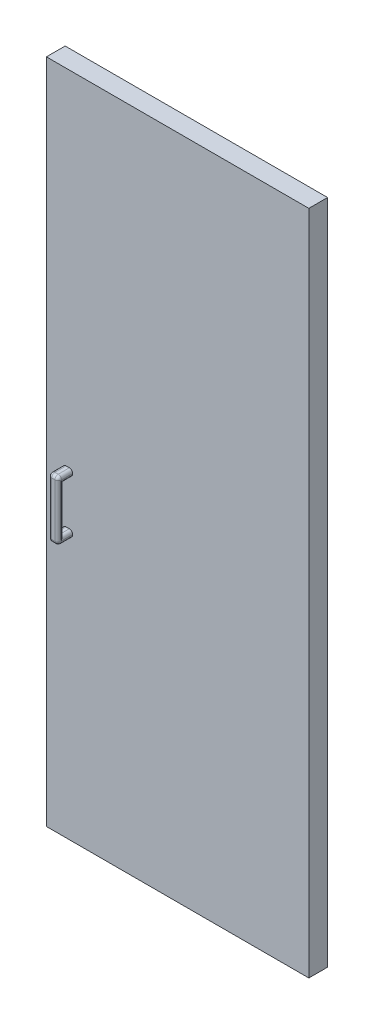
ISO-10303-21;
HEADER;
FILE_DESCRIPTION(('STEP AP214'),'2;1');
FILE_NAME('part.step','',(''),(''),'','','');
FILE_SCHEMA(('AUTOMOTIVE_DESIGN { 1 0 10303 214 1 1 1 1 }'));
ENDSEC;
DATA;
#1=APPLICATION_CONTEXT('core data for automotive mechanical design processes');
#2=APPLICATION_PROTOCOL_DEFINITION('international standard','automotive_design',2000,#1);
#3=PRODUCT_CONTEXT('',#1,'mechanical');
#4=PRODUCT('Part','Part','',(#3));
#5=PRODUCT_RELATED_PRODUCT_CATEGORY('part','',(#4));
#6=PRODUCT_DEFINITION_FORMATION('','',#4);
#7=PRODUCT_DEFINITION_CONTEXT('part definition',#1,'design');
#8=PRODUCT_DEFINITION('design','',#6,#7);
#9=PRODUCT_DEFINITION_SHAPE('','',#8);
#10=(LENGTH_UNIT() NAMED_UNIT(*) SI_UNIT(.MILLI.,.METRE.));
#11=(NAMED_UNIT(*) PLANE_ANGLE_UNIT() SI_UNIT($,.RADIAN.));
#12=(NAMED_UNIT(*) SI_UNIT($,.STERADIAN.) SOLID_ANGLE_UNIT());
#13=UNCERTAINTY_MEASURE_WITH_UNIT(LENGTH_MEASURE(1.E-05),#10,'distance_accuracy_value','');
#14=(GEOMETRIC_REPRESENTATION_CONTEXT(3) GLOBAL_UNCERTAINTY_ASSIGNED_CONTEXT((#13)) GLOBAL_UNIT_ASSIGNED_CONTEXT((#10,
#11,#12)) REPRESENTATION_CONTEXT('',''));
#15=CARTESIAN_POINT('',(0.,0.,0.));
#16=DIRECTION('',(0.,0.,1.));
#17=DIRECTION('',(1.,0.,0.));
#18=AXIS2_PLACEMENT_3D('',#15,#16,#17);
#19=CARTESIAN_POINT('',(0.,0.,0.));
#20=DIRECTION('',(0.,0.,1.));
#21=DIRECTION('',(1.,0.,0.));
#22=AXIS2_PLACEMENT_3D('',#19,#20,#21);
#23=PLANE('',#22);
#24=DIRECTION('',(-1.,0.,0.));
#25=VECTOR('',#24,1.);
#26=CARTESIAN_POINT('',(0.,446.201837212028,0.));
#27=LINE('',#26,#25);
#28=CARTESIAN_POINT('',(0.,446.201837212028,0.));
#29=VERTEX_POINT('',#28);
#30=CARTESIAN_POINT('',(-800.,446.201837212028,0.));
#31=VERTEX_POINT('',#30);
#32=EDGE_CURVE('E281',#29,#31,#27,.T.);
#33=ORIENTED_EDGE('',*,*,#32,.F.);
#34=DIRECTION('',(0.,1.,0.));
#35=VECTOR('',#34,1.);
#36=CARTESIAN_POINT('',(0.,0.,0.));
#37=LINE('',#36,#35);
#38=CARTESIAN_POINT('',(0.,-1585.79816278797,0.));
#39=VERTEX_POINT('',#38);
#40=EDGE_CURVE('E286',#39,#29,#37,.T.);
#41=ORIENTED_EDGE('',*,*,#40,.F.);
#42=DIRECTION('',(1.,0.,0.));
#43=VECTOR('',#42,1.);
#44=CARTESIAN_POINT('',(-800.,-1585.79816278797,0.));
#45=LINE('',#44,#43);
#46=CARTESIAN_POINT('',(-800.,-1585.79816278797,0.));
#47=VERTEX_POINT('',#46);
#48=EDGE_CURVE('E297',#47,#39,#45,.T.);
#49=ORIENTED_EDGE('',*,*,#48,.F.);
#50=DIRECTION('',(0.,-1.,0.));
#51=VECTOR('',#50,1.);
#52=CARTESIAN_POINT('',(-800.,446.201837212028,0.));
#53=LINE('',#52,#51);
#54=EDGE_CURVE('E295',#31,#47,#53,.T.);
#55=ORIENTED_EDGE('',*,*,#54,.F.);
#56=EDGE_LOOP('',(#33,#41,#49,#55));
#57=FACE_BOUND('',#56,.T.);
#58=DIRECTION('',(0.,1.,0.));
#59=VECTOR('',#58,1.);
#60=CARTESIAN_POINT('',(-775.,-924.798162787972,0.));
#61=LINE('',#60,#59);
#62=CARTESIAN_POINT('',(-775.,-924.798162787972,0.));
#63=VERTEX_POINT('',#62);
#64=CARTESIAN_POINT('',(-775.,-464.798162787972,0.));
#65=VERTEX_POINT('',#64);
#66=EDGE_CURVE('E245',#63,#65,#61,.T.);
#67=ORIENTED_EDGE('',*,*,#66,.F.);
#68=DIRECTION('',(-1.,0.,0.));
#69=VECTOR('',#68,1.);
#70=CARTESIAN_POINT('',(-655.,-924.798162787972,0.));
#71=LINE('',#70,#69);
#72=CARTESIAN_POINT('',(-655.,-924.798162787972,0.));
#73=VERTEX_POINT('',#72);
#74=EDGE_CURVE('E242',#73,#63,#71,.T.);
#75=ORIENTED_EDGE('',*,*,#74,.F.);
#76=DIRECTION('',(0.,-1.,0.));
#77=VECTOR('',#76,1.);
#78=CARTESIAN_POINT('',(-655.,-924.798162787972,0.));
#79=LINE('',#78,#77);
#80=CARTESIAN_POINT('',(-655.,-464.798162787972,0.));
#81=VERTEX_POINT('',#80);
#82=EDGE_CURVE('E61',#81,#73,#79,.T.);
#83=ORIENTED_EDGE('',*,*,#82,.F.);
#84=DIRECTION('',(1.,0.,0.));
#85=VECTOR('',#84,1.);
#86=CARTESIAN_POINT('',(-655.,-464.798162787972,0.));
#87=LINE('',#86,#85);
#88=EDGE_CURVE('E56',#65,#81,#87,.T.);
#89=ORIENTED_EDGE('',*,*,#88,.F.);
#90=EDGE_LOOP('',(#67,#75,#83,#89));
#91=FACE_BOUND('',#90,.T.);
#92=ADVANCED_FACE('F39',(#57,#91),#23,.F.);
#93=CARTESIAN_POINT('',(-720.,-603.798162787972,101.15));
#94=DIRECTION('',(-1.,0.,0.));
#95=DIRECTION('',(0.,0.,1.));
#96=AXIS2_PLACEMENT_3D('',#93,#94,#95);
#97=PLANE('',#96);
#98=DIRECTION('',(0.,1.,0.));
#99=VECTOR('',#98,1.);
#100=CARTESIAN_POINT('',(-720.,-603.798162787972,57.15));
#101=LINE('',#100,#99);
#102=CARTESIAN_POINT('',(-720.,-614.798162787972,57.15));
#103=VERTEX_POINT('',#102);
#104=CARTESIAN_POINT('',(-720.,-613.798162787972,57.15));
#105=VERTEX_POINT('',#104);
#106=EDGE_CURVE('E274',#103,#105,#101,.T.);
#107=ORIENTED_EDGE('',*,*,#106,.T.);
#108=DIRECTION('',(0.,0.,-1.));
#109=VECTOR('',#108,1.);
#110=CARTESIAN_POINT('',(-720.,-613.798162787972,101.15));
#111=LINE('',#110,#109);
#112=CARTESIAN_POINT('',(-720.,-613.798162787972,91.15));
#113=VERTEX_POINT('',#112);
#114=EDGE_CURVE('E350',#105,#113,#111,.F.);
#115=ORIENTED_EDGE('',*,*,#114,.T.);
#116=DIRECTION('',(0.,1.,0.));
#117=VECTOR('',#116,1.);
#118=CARTESIAN_POINT('',(-720.,-785.798162787972,91.15));
#119=LINE('',#118,#117);
#120=CARTESIAN_POINT('',(-720.,-614.798162787972,91.15));
#121=VERTEX_POINT('',#120);
#122=EDGE_CURVE('E346',#113,#121,#119,.F.);
#123=ORIENTED_EDGE('',*,*,#122,.T.);
#124=DIRECTION('',(0.,0.,-1.));
#125=VECTOR('',#124,1.);
#126=CARTESIAN_POINT('',(-720.,-614.798162787972,101.15));
#127=LINE('',#126,#125);
#128=EDGE_CURVE('E348',#121,#103,#127,.T.);
#129=ORIENTED_EDGE('',*,*,#128,.T.);
#130=EDGE_LOOP('',(#107,#115,#123,#129));
#131=FACE_BOUND('',#130,.T.);
#132=ADVANCED_FACE('F552',(#131),#97,.F.);
#133=CARTESIAN_POINT('',(-750.,-603.798162787972,101.15));
#134=DIRECTION('',(1.,0.,0.));
#135=DIRECTION('',(0.,0.,-1.));
#136=AXIS2_PLACEMENT_3D('',#133,#134,#135);
#137=PLANE('',#136);
#138=DIRECTION('',(0.,-1.,0.));
#139=VECTOR('',#138,1.);
#140=CARTESIAN_POINT('',(-750.,-603.798162787972,91.15));
#141=LINE('',#140,#139);
#142=CARTESIAN_POINT('',(-750.,-614.798162787972,91.15));
#143=VERTEX_POINT('',#142);
#144=CARTESIAN_POINT('',(-750.,-613.798162787972,91.15));
#145=VERTEX_POINT('',#144);
#146=EDGE_CURVE('E318',#143,#145,#141,.F.);
#147=ORIENTED_EDGE('',*,*,#146,.T.);
#148=DIRECTION('',(0.,0.,-1.));
#149=VECTOR('',#148,1.);
#150=CARTESIAN_POINT('',(-750.,-613.798162787972,101.15));
#151=LINE('',#150,#149);
#152=CARTESIAN_POINT('',(-750.,-613.798162787972,57.15));
#153=VERTEX_POINT('',#152);
#154=EDGE_CURVE('E322',#145,#153,#151,.T.);
#155=ORIENTED_EDGE('',*,*,#154,.T.);
#156=DIRECTION('',(0.,-1.,0.));
#157=VECTOR('',#156,1.);
#158=CARTESIAN_POINT('',(-750.,-603.798162787972,57.15));
#159=LINE('',#158,#157);
#160=CARTESIAN_POINT('',(-750.,-614.798162787972,57.15));
#161=VERTEX_POINT('',#160);
#162=EDGE_CURVE('E270',#153,#161,#159,.T.);
#163=ORIENTED_EDGE('',*,*,#162,.T.);
#164=DIRECTION('',(0.,0.,-1.));
#165=VECTOR('',#164,1.);
#166=CARTESIAN_POINT('',(-750.,-614.798162787972,101.15));
#167=LINE('',#166,#165);
#168=EDGE_CURVE('E320',#161,#143,#167,.F.);
#169=ORIENTED_EDGE('',*,*,#168,.T.);
#170=EDGE_LOOP('',(#147,#155,#163,#169));
#171=FACE_BOUND('',#170,.T.);
#172=ADVANCED_FACE('F519',(#171),#137,.F.);
#173=CARTESIAN_POINT('',(0.,0.,57.15));
#174=DIRECTION('',(0.,0.,1.));
#175=DIRECTION('',(1.,0.,0.));
#176=AXIS2_PLACEMENT_3D('',#173,#174,#175);
#177=PLANE('',#176);
#178=ORIENTED_EDGE('',*,*,#106,.F.);
#179=CARTESIAN_POINT('',(-730.,-614.798162787972,57.15));
#180=DIRECTION('',(0.,0.,1.));
#181=DIRECTION('',(1.,0.,0.));
#182=AXIS2_PLACEMENT_3D('',#179,#180,#181);
#183=CIRCLE('',#182,10.);
#184=CARTESIAN_POINT('',(-730.,-624.798162787972,57.15));
#185=VERTEX_POINT('',#184);
#186=EDGE_CURVE('E374',#103,#185,#183,.F.);
#187=ORIENTED_EDGE('',*,*,#186,.T.);
#188=DIRECTION('',(-1.,0.,0.));
#189=VECTOR('',#188,1.);
#190=CARTESIAN_POINT('',(-692.85,-624.798162787972,57.15));
#191=LINE('',#190,#189);
#192=CARTESIAN_POINT('',(-740.,-624.798162787972,57.15));
#193=VERTEX_POINT('',#192);
#194=EDGE_CURVE('E255',#185,#193,#191,.T.);
#195=ORIENTED_EDGE('',*,*,#194,.T.);
#196=CARTESIAN_POINT('',(-740.,-614.798162787972,57.15));
#197=DIRECTION('',(0.,0.,1.));
#198=DIRECTION('',(1.,0.,0.));
#199=AXIS2_PLACEMENT_3D('',#196,#197,#198);
#200=CIRCLE('',#199,10.);
#201=EDGE_CURVE('E376',#193,#161,#200,.F.);
#202=ORIENTED_EDGE('',*,*,#201,.T.);
#203=ORIENTED_EDGE('',*,*,#162,.F.);
#204=CARTESIAN_POINT('',(-740.,-613.798162787972,57.15));
#205=DIRECTION('',(0.,0.,1.));
#206=DIRECTION('',(1.,0.,0.));
#207=AXIS2_PLACEMENT_3D('',#204,#205,#206);
#208=CIRCLE('',#207,10.);
#209=CARTESIAN_POINT('',(-740.,-603.798162787972,57.15));
#210=VERTEX_POINT('',#209);
#211=EDGE_CURVE('E370',#153,#210,#208,.F.);
#212=ORIENTED_EDGE('',*,*,#211,.T.);
#213=DIRECTION('',(-1.,0.,0.));
#214=VECTOR('',#213,1.);
#215=CARTESIAN_POINT('',(-750.,-603.798162787972,57.15));
#216=LINE('',#215,#214);
#217=CARTESIAN_POINT('',(-730.,-603.798162787972,57.15));
#218=VERTEX_POINT('',#217);
#219=EDGE_CURVE('E278',#218,#210,#216,.T.);
#220=ORIENTED_EDGE('',*,*,#219,.F.);
#221=CARTESIAN_POINT('',(-730.,-613.798162787972,57.15));
#222=DIRECTION('',(0.,0.,1.));
#223=DIRECTION('',(1.,0.,0.));
#224=AXIS2_PLACEMENT_3D('',#221,#222,#223);
#225=CIRCLE('',#224,10.);
#226=EDGE_CURVE('E372',#218,#105,#225,.F.);
#227=ORIENTED_EDGE('',*,*,#226,.T.);
#228=EDGE_LOOP('',(#178,#187,#195,#202,#203,#212,#220,#227));
#229=FACE_BOUND('',#228,.T.);
#230=DIRECTION('',(-1.,0.,0.));
#231=VECTOR('',#230,1.);
#232=CARTESIAN_POINT('',(-692.85,-764.798162787972,57.15));
#233=LINE('',#232,#231);
#234=CARTESIAN_POINT('',(-730.,-764.798162787972,57.15));
#235=VERTEX_POINT('',#234);
#236=CARTESIAN_POINT('',(-740.,-764.798162787972,57.15));
#237=VERTEX_POINT('',#236);
#238=EDGE_CURVE('E265',#235,#237,#233,.T.);
#239=ORIENTED_EDGE('',*,*,#238,.F.);
#240=CARTESIAN_POINT('',(-730.,-774.798162787972,57.15));
#241=DIRECTION('',(0.,0.,1.));
#242=DIRECTION('',(1.,0.,0.));
#243=AXIS2_PLACEMENT_3D('',#240,#241,#242);
#244=CIRCLE('',#243,10.);
#245=CARTESIAN_POINT('',(-720.,-774.798162787972,57.15));
#246=VERTEX_POINT('',#245);
#247=EDGE_CURVE('E378',#235,#246,#244,.F.);
#248=ORIENTED_EDGE('',*,*,#247,.T.);
#249=CARTESIAN_POINT('',(-720.,-775.798162787972,57.15));
#250=VERTEX_POINT('',#249);
#251=EDGE_CURVE('E275',#250,#246,#101,.T.);
#252=ORIENTED_EDGE('',*,*,#251,.F.);
#253=CARTESIAN_POINT('',(-730.,-775.798162787972,57.15));
#254=DIRECTION('',(0.,0.,1.));
#255=DIRECTION('',(1.,0.,0.));
#256=AXIS2_PLACEMENT_3D('',#253,#254,#255);
#257=CIRCLE('',#256,10.);
#258=CARTESIAN_POINT('',(-730.,-785.798162787972,57.15));
#259=VERTEX_POINT('',#258);
#260=EDGE_CURVE('E11',#250,#259,#257,.F.);
#261=ORIENTED_EDGE('',*,*,#260,.T.);
#262=DIRECTION('',(1.,0.,0.));
#263=VECTOR('',#262,1.);
#264=CARTESIAN_POINT('',(-750.,-785.798162787972,57.15));
#265=LINE('',#264,#263);
#266=CARTESIAN_POINT('',(-740.,-785.798162787972,57.15));
#267=VERTEX_POINT('',#266);
#268=EDGE_CURVE('E271',#267,#259,#265,.T.);
#269=ORIENTED_EDGE('',*,*,#268,.F.);
#270=CARTESIAN_POINT('',(-740.,-775.798162787972,57.15));
#271=DIRECTION('',(0.,0.,1.));
#272=DIRECTION('',(1.,0.,0.));
#273=AXIS2_PLACEMENT_3D('',#270,#271,#272);
#274=CIRCLE('',#273,10.);
#275=CARTESIAN_POINT('',(-750.,-775.798162787972,57.15));
#276=VERTEX_POINT('',#275);
#277=EDGE_CURVE('E48',#267,#276,#274,.F.);
#278=ORIENTED_EDGE('',*,*,#277,.T.);
#279=CARTESIAN_POINT('',(-750.,-774.798162787972,57.15));
#280=VERTEX_POINT('',#279);
#281=EDGE_CURVE('E258',#280,#276,#159,.T.);
#282=ORIENTED_EDGE('',*,*,#281,.F.);
#283=CARTESIAN_POINT('',(-740.,-774.798162787972,57.15));
#284=DIRECTION('',(0.,0.,1.));
#285=DIRECTION('',(1.,0.,0.));
#286=AXIS2_PLACEMENT_3D('',#283,#284,#285);
#287=CIRCLE('',#286,10.);
#288=EDGE_CURVE('E380',#280,#237,#287,.F.);
#289=ORIENTED_EDGE('',*,*,#288,.T.);
#290=EDGE_LOOP('',(#239,#248,#252,#261,#269,#278,#282,#289));
#291=FACE_BOUND('',#290,.T.);
#292=DIRECTION('',(-1.,0.,0.));
#293=VECTOR('',#292,1.);
#294=CARTESIAN_POINT('',(0.,446.201837212028,57.15));
#295=LINE('',#294,#293);
#296=CARTESIAN_POINT('',(0.,446.201837212028,57.15));
#297=VERTEX_POINT('',#296);
#298=CARTESIAN_POINT('',(-800.,446.201837212028,57.15));
#299=VERTEX_POINT('',#298);
#300=EDGE_CURVE('E282',#297,#299,#295,.T.);
#301=ORIENTED_EDGE('',*,*,#300,.T.);
#302=DIRECTION('',(0.,-1.,0.));
#303=VECTOR('',#302,1.);
#304=CARTESIAN_POINT('',(-800.,446.201837212028,57.15));
#305=LINE('',#304,#303);
#306=CARTESIAN_POINT('',(-800.,-1585.79816278797,57.15));
#307=VERTEX_POINT('',#306);
#308=EDGE_CURVE('E285',#299,#307,#305,.T.);
#309=ORIENTED_EDGE('',*,*,#308,.T.);
#310=DIRECTION('',(1.,0.,0.));
#311=VECTOR('',#310,1.);
#312=CARTESIAN_POINT('',(-800.,-1585.79816278797,57.15));
#313=LINE('',#312,#311);
#314=CARTESIAN_POINT('',(0.,-1585.79816278797,57.15));
#315=VERTEX_POINT('',#314);
#316=EDGE_CURVE('E288',#307,#315,#313,.T.);
#317=ORIENTED_EDGE('',*,*,#316,.T.);
#318=DIRECTION('',(0.,1.,0.));
#319=VECTOR('',#318,1.);
#320=CARTESIAN_POINT('',(0.,-1585.79816278797,57.15));
#321=LINE('',#320,#319);
#322=EDGE_CURVE('E290',#315,#297,#321,.T.);
#323=ORIENTED_EDGE('',*,*,#322,.T.);
#324=EDGE_LOOP('',(#301,#309,#317,#323));
#325=FACE_BOUND('',#324,.T.);
#326=ADVANCED_FACE('F465',(#229,#291,#325),#177,.T.);
#327=CARTESIAN_POINT('',(0.,446.201837212028,57.15));
#328=DIRECTION('',(0.,-1.,0.));
#329=DIRECTION('',(1.,0.,0.));
#330=AXIS2_PLACEMENT_3D('',#327,#328,#329);
#331=PLANE('',#330);
#332=ORIENTED_EDGE('',*,*,#32,.T.);
#333=DIRECTION('',(0.,0.,-1.));
#334=VECTOR('',#333,1.);
#335=CARTESIAN_POINT('',(-800.,446.201837212028,57.15));
#336=LINE('',#335,#334);
#337=EDGE_CURVE('E309',#299,#31,#336,.T.);
#338=ORIENTED_EDGE('',*,*,#337,.F.);
#339=ORIENTED_EDGE('',*,*,#300,.F.);
#340=DIRECTION('',(0.,0.,-1.));
#341=VECTOR('',#340,1.);
#342=CARTESIAN_POINT('',(0.,446.201837212028,57.15));
#343=LINE('',#342,#341);
#344=EDGE_CURVE('E292',#297,#29,#343,.T.);
#345=ORIENTED_EDGE('',*,*,#344,.T.);
#346=EDGE_LOOP('',(#332,#338,#339,#345));
#347=FACE_BOUND('',#346,.T.);
#348=ADVANCED_FACE('F575',(#347),#331,.F.);
#349=CARTESIAN_POINT('',(-800.,446.201837212028,57.15));
#350=DIRECTION('',(1.,0.,0.));
#351=DIRECTION('',(0.,1.,0.));
#352=AXIS2_PLACEMENT_3D('',#349,#350,#351);
#353=PLANE('',#352);
#354=ORIENTED_EDGE('',*,*,#54,.T.);
#355=DIRECTION('',(0.,0.,-1.));
#356=VECTOR('',#355,1.);
#357=CARTESIAN_POINT('',(-800.,-1585.79816278797,57.15));
#358=LINE('',#357,#356);
#359=EDGE_CURVE('E306',#307,#47,#358,.T.);
#360=ORIENTED_EDGE('',*,*,#359,.F.);
#361=ORIENTED_EDGE('',*,*,#308,.F.);
#362=ORIENTED_EDGE('',*,*,#337,.T.);
#363=EDGE_LOOP('',(#354,#360,#361,#362));
#364=FACE_BOUND('',#363,.T.);
#365=ADVANCED_FACE('F583',(#364),#353,.F.);
#366=CARTESIAN_POINT('',(-800.,-1585.79816278797,57.15));
#367=DIRECTION('',(0.,1.,0.));
#368=DIRECTION('',(0.,0.,1.));
#369=AXIS2_PLACEMENT_3D('',#366,#367,#368);
#370=PLANE('',#369);
#371=ORIENTED_EDGE('',*,*,#48,.T.);
#372=DIRECTION('',(0.,0.,-1.));
#373=VECTOR('',#372,1.);
#374=CARTESIAN_POINT('',(0.,-1585.79816278797,57.15));
#375=LINE('',#374,#373);
#376=EDGE_CURVE('E303',#315,#39,#375,.T.);
#377=ORIENTED_EDGE('',*,*,#376,.F.);
#378=ORIENTED_EDGE('',*,*,#316,.F.);
#379=ORIENTED_EDGE('',*,*,#359,.T.);
#380=EDGE_LOOP('',(#371,#377,#378,#379));
#381=FACE_BOUND('',#380,.T.);
#382=ADVANCED_FACE('F579',(#381),#370,.F.);
#383=CARTESIAN_POINT('',(0.,0.,57.15));
#384=DIRECTION('',(-1.,0.,0.));
#385=DIRECTION('',(0.,0.,1.));
#386=AXIS2_PLACEMENT_3D('',#383,#384,#385);
#387=PLANE('',#386);
#388=ORIENTED_EDGE('',*,*,#40,.T.);
#389=ORIENTED_EDGE('',*,*,#344,.F.);
#390=ORIENTED_EDGE('',*,*,#322,.F.);
#391=ORIENTED_EDGE('',*,*,#376,.T.);
#392=EDGE_LOOP('',(#388,#389,#390,#391));
#393=FACE_BOUND('',#392,.T.);
#394=ADVANCED_FACE('F572',(#393),#387,.F.);
#395=DIRECTION('',(0.,-1.,0.));
#396=VECTOR('',#395,1.);
#397=CARTESIAN_POINT('',(-750.,-603.798162787972,91.15));
#398=LINE('',#397,#396);
#399=CARTESIAN_POINT('',(-750.,-775.798162787972,91.15));
#400=VERTEX_POINT('',#399);
#401=CARTESIAN_POINT('',(-750.,-774.798162787972,91.15));
#402=VERTEX_POINT('',#401);
#403=EDGE_CURVE('E314',#400,#402,#398,.F.);
#404=ORIENTED_EDGE('',*,*,#403,.T.);
#405=DIRECTION('',(0.,0.,1.));
#406=VECTOR('',#405,1.);
#407=CARTESIAN_POINT('',(-750.,-774.798162787972,101.15));
#408=LINE('',#407,#406);
#409=EDGE_CURVE('E316',#402,#280,#408,.F.);
#410=ORIENTED_EDGE('',*,*,#409,.T.);
#411=ORIENTED_EDGE('',*,*,#281,.T.);
#412=DIRECTION('',(0.,0.,-1.));
#413=VECTOR('',#412,1.);
#414=CARTESIAN_POINT('',(-750.,-775.798162787972,101.15));
#415=LINE('',#414,#413);
#416=EDGE_CURVE('E312',#276,#400,#415,.F.);
#417=ORIENTED_EDGE('',*,*,#416,.T.);
#418=EDGE_LOOP('',(#404,#410,#411,#417));
#419=FACE_BOUND('',#418,.T.);
#420=ADVANCED_FACE('F485',(#419),#137,.F.);
#421=CARTESIAN_POINT('',(-750.,-785.798162787972,101.15));
#422=DIRECTION('',(0.,1.,0.));
#423=DIRECTION('',(-1.,0.,0.));
#424=AXIS2_PLACEMENT_3D('',#421,#422,#423);
#425=PLANE('',#424);
#426=DIRECTION('',(1.,0.,0.));
#427=VECTOR('',#426,1.);
#428=CARTESIAN_POINT('',(-750.,-785.798162787972,91.15));
#429=LINE('',#428,#427);
#430=CARTESIAN_POINT('',(-730.,-785.798162787972,91.15));
#431=VERTEX_POINT('',#430);
#432=CARTESIAN_POINT('',(-740.,-785.798162787972,91.15));
#433=VERTEX_POINT('',#432);
#434=EDGE_CURVE('E364',#431,#433,#429,.F.);
#435=ORIENTED_EDGE('',*,*,#434,.T.);
#436=DIRECTION('',(0.,0.,-1.));
#437=VECTOR('',#436,1.);
#438=CARTESIAN_POINT('',(-740.,-785.798162787972,101.15));
#439=LINE('',#438,#437);
#440=EDGE_CURVE('E368',#433,#267,#439,.T.);
#441=ORIENTED_EDGE('',*,*,#440,.T.);
#442=ORIENTED_EDGE('',*,*,#268,.T.);
#443=DIRECTION('',(0.,0.,-1.));
#444=VECTOR('',#443,1.);
#445=CARTESIAN_POINT('',(-730.,-785.798162787972,101.15));
#446=LINE('',#445,#444);
#447=EDGE_CURVE('E366',#259,#431,#446,.F.);
#448=ORIENTED_EDGE('',*,*,#447,.T.);
#449=EDGE_LOOP('',(#435,#441,#442,#448));
#450=FACE_BOUND('',#449,.T.);
#451=ADVANCED_FACE('F473',(#450),#425,.F.);
#452=ORIENTED_EDGE('',*,*,#251,.T.);
#453=DIRECTION('',(0.,0.,1.));
#454=VECTOR('',#453,1.);
#455=CARTESIAN_POINT('',(-720.,-774.798162787972,101.15));
#456=LINE('',#455,#454);
#457=CARTESIAN_POINT('',(-720.,-774.798162787972,91.15));
#458=VERTEX_POINT('',#457);
#459=EDGE_CURVE('E344',#246,#458,#456,.T.);
#460=ORIENTED_EDGE('',*,*,#459,.T.);
#461=DIRECTION('',(0.,1.,0.));
#462=VECTOR('',#461,1.);
#463=CARTESIAN_POINT('',(-720.,-785.798162787972,91.15));
#464=LINE('',#463,#462);
#465=CARTESIAN_POINT('',(-720.,-775.798162787972,91.15));
#466=VERTEX_POINT('',#465);
#467=EDGE_CURVE('E340',#458,#466,#464,.F.);
#468=ORIENTED_EDGE('',*,*,#467,.T.);
#469=DIRECTION('',(0.,0.,-1.));
#470=VECTOR('',#469,1.);
#471=CARTESIAN_POINT('',(-720.,-775.798162787972,101.15));
#472=LINE('',#471,#470);
#473=EDGE_CURVE('E342',#466,#250,#472,.T.);
#474=ORIENTED_EDGE('',*,*,#473,.T.);
#475=EDGE_LOOP('',(#452,#460,#468,#474));
#476=FACE_BOUND('',#475,.T.);
#477=ADVANCED_FACE('F459',(#476),#97,.F.);
#478=CARTESIAN_POINT('',(-750.,-603.798162787972,101.15));
#479=DIRECTION('',(0.,-1.,0.));
#480=DIRECTION('',(1.,0.,0.));
#481=AXIS2_PLACEMENT_3D('',#478,#479,#480);
#482=PLANE('',#481);
#483=ORIENTED_EDGE('',*,*,#219,.T.);
#484=DIRECTION('',(0.,0.,-1.));
#485=VECTOR('',#484,1.);
#486=CARTESIAN_POINT('',(-740.,-603.798162787972,101.15));
#487=LINE('',#486,#485);
#488=CARTESIAN_POINT('',(-740.,-603.798162787972,91.15));
#489=VERTEX_POINT('',#488);
#490=EDGE_CURVE('E329',#210,#489,#487,.F.);
#491=ORIENTED_EDGE('',*,*,#490,.T.);
#492=DIRECTION('',(-1.,0.,0.));
#493=VECTOR('',#492,1.);
#494=CARTESIAN_POINT('',(-720.,-603.798162787972,91.15));
#495=LINE('',#494,#493);
#496=CARTESIAN_POINT('',(-730.,-603.798162787972,91.15));
#497=VERTEX_POINT('',#496);
#498=EDGE_CURVE('E327',#489,#497,#495,.F.);
#499=ORIENTED_EDGE('',*,*,#498,.T.);
#500=DIRECTION('',(0.,0.,-1.));
#501=VECTOR('',#500,1.);
#502=CARTESIAN_POINT('',(-730.,-603.798162787972,101.15));
#503=LINE('',#502,#501);
#504=EDGE_CURVE('E325',#497,#218,#503,.T.);
#505=ORIENTED_EDGE('',*,*,#504,.T.);
#506=EDGE_LOOP('',(#483,#491,#499,#505));
#507=FACE_BOUND('',#506,.T.);
#508=ADVANCED_FACE('F530',(#507),#482,.F.);
#509=CARTESIAN_POINT('',(0.,0.,101.15));
#510=DIRECTION('',(0.,0.,1.));
#511=DIRECTION('',(1.,0.,0.));
#512=AXIS2_PLACEMENT_3D('',#509,#510,#511);
#513=PLANE('',#512);
#514=DIRECTION('',(0.,1.,0.));
#515=VECTOR('',#514,1.);
#516=CARTESIAN_POINT('',(-730.,-603.798162787972,101.15));
#517=LINE('',#516,#515);
#518=CARTESIAN_POINT('',(-730.,-775.798162787972,101.15));
#519=VERTEX_POINT('',#518);
#520=CARTESIAN_POINT('',(-730.,-613.798162787972,101.15));
#521=VERTEX_POINT('',#520);
#522=EDGE_CURVE('E333',#519,#521,#517,.T.);
#523=ORIENTED_EDGE('',*,*,#522,.T.);
#524=DIRECTION('',(-1.,0.,0.));
#525=VECTOR('',#524,1.);
#526=CARTESIAN_POINT('',(-750.,-613.798162787972,101.15));
#527=LINE('',#526,#525);
#528=CARTESIAN_POINT('',(-740.,-613.798162787972,101.15));
#529=VERTEX_POINT('',#528);
#530=EDGE_CURVE('E337',#521,#529,#527,.T.);
#531=ORIENTED_EDGE('',*,*,#530,.T.);
#532=DIRECTION('',(0.,-1.,0.));
#533=VECTOR('',#532,1.);
#534=CARTESIAN_POINT('',(-740.,-785.798162787972,101.15));
#535=LINE('',#534,#533);
#536=CARTESIAN_POINT('',(-740.,-775.798162787972,101.15));
#537=VERTEX_POINT('',#536);
#538=EDGE_CURVE('E335',#529,#537,#535,.T.);
#539=ORIENTED_EDGE('',*,*,#538,.T.);
#540=DIRECTION('',(1.,0.,0.));
#541=VECTOR('',#540,1.);
#542=CARTESIAN_POINT('',(-720.,-775.798162787972,101.15));
#543=LINE('',#542,#541);
#544=EDGE_CURVE('E331',#537,#519,#543,.T.);
#545=ORIENTED_EDGE('',*,*,#544,.T.);
#546=EDGE_LOOP('',(#523,#531,#539,#545));
#547=FACE_BOUND('',#546,.T.);
#548=ADVANCED_FACE('F547',(#547),#513,.T.);
#549=CARTESIAN_POINT('',(-692.85,-624.798162787972,83.15));
#550=DIRECTION('',(0.,1.,0.));
#551=DIRECTION('',(0.,0.,1.));
#552=AXIS2_PLACEMENT_3D('',#549,#550,#551);
#553=PLANE('',#552);
#554=ORIENTED_EDGE('',*,*,#194,.F.);
#555=DIRECTION('',(0.,0.,-1.));
#556=VECTOR('',#555,1.);
#557=CARTESIAN_POINT('',(-730.,-624.798162787972,83.15));
#558=LINE('',#557,#556);
#559=CARTESIAN_POINT('',(-730.,-624.798162787972,83.15));
#560=VERTEX_POINT('',#559);
#561=EDGE_CURVE('E354',#185,#560,#558,.F.);
#562=ORIENTED_EDGE('',*,*,#561,.T.);
#563=DIRECTION('',(-1.,0.,0.));
#564=VECTOR('',#563,1.);
#565=CARTESIAN_POINT('',(-692.85,-624.798162787972,83.15));
#566=LINE('',#565,#564);
#567=CARTESIAN_POINT('',(-740.,-624.798162787972,83.15));
#568=VERTEX_POINT('',#567);
#569=EDGE_CURVE('E259',#560,#568,#566,.T.);
#570=ORIENTED_EDGE('',*,*,#569,.T.);
#571=DIRECTION('',(0.,0.,-1.));
#572=VECTOR('',#571,1.);
#573=CARTESIAN_POINT('',(-740.,-624.798162787972,83.15));
#574=LINE('',#573,#572);
#575=EDGE_CURVE('E352',#568,#193,#574,.T.);
#576=ORIENTED_EDGE('',*,*,#575,.T.);
#577=EDGE_LOOP('',(#554,#562,#570,#576));
#578=FACE_BOUND('',#577,.T.);
#579=ADVANCED_FACE('F504',(#578),#553,.F.);
#580=CARTESIAN_POINT('',(-692.85,-764.798162787972,83.15));
#581=DIRECTION('',(0.,0.,1.));
#582=DIRECTION('',(1.,0.,0.));
#583=AXIS2_PLACEMENT_3D('',#580,#581,#582);
#584=PLANE('',#583);
#585=ORIENTED_EDGE('',*,*,#569,.F.);
#586=DIRECTION('',(0.,1.,0.));
#587=VECTOR('',#586,1.);
#588=CARTESIAN_POINT('',(-730.,-764.798162787972,83.15));
#589=LINE('',#588,#587);
#590=CARTESIAN_POINT('',(-730.,-764.798162787972,83.15));
#591=VERTEX_POINT('',#590);
#592=EDGE_CURVE('E358',#560,#591,#589,.F.);
#593=ORIENTED_EDGE('',*,*,#592,.T.);
#594=DIRECTION('',(-1.,0.,0.));
#595=VECTOR('',#594,1.);
#596=CARTESIAN_POINT('',(-692.85,-764.798162787972,83.15));
#597=LINE('',#596,#595);
#598=CARTESIAN_POINT('',(-740.,-764.798162787972,83.15));
#599=VERTEX_POINT('',#598);
#600=EDGE_CURVE('E262',#591,#599,#597,.T.);
#601=ORIENTED_EDGE('',*,*,#600,.T.);
#602=DIRECTION('',(0.,1.,0.));
#603=VECTOR('',#602,1.);
#604=CARTESIAN_POINT('',(-740.,-764.798162787972,83.15));
#605=LINE('',#604,#603);
#606=EDGE_CURVE('E356',#599,#568,#605,.T.);
#607=ORIENTED_EDGE('',*,*,#606,.T.);
#608=EDGE_LOOP('',(#585,#593,#601,#607));
#609=FACE_BOUND('',#608,.T.);
#610=ADVANCED_FACE('F500',(#609),#584,.F.);
#611=CARTESIAN_POINT('',(-692.85,-764.798162787972,57.15));
#612=DIRECTION('',(0.,-1.,0.));
#613=DIRECTION('',(0.,0.,-1.));
#614=AXIS2_PLACEMENT_3D('',#611,#612,#613);
#615=PLANE('',#614);
#616=ORIENTED_EDGE('',*,*,#600,.F.);
#617=DIRECTION('',(0.,0.,1.));
#618=VECTOR('',#617,1.);
#619=CARTESIAN_POINT('',(-730.,-764.798162787972,57.15));
#620=LINE('',#619,#618);
#621=EDGE_CURVE('E362',#591,#235,#620,.F.);
#622=ORIENTED_EDGE('',*,*,#621,.T.);
#623=ORIENTED_EDGE('',*,*,#238,.T.);
#624=DIRECTION('',(0.,0.,1.));
#625=VECTOR('',#624,1.);
#626=CARTESIAN_POINT('',(-740.,-764.798162787972,57.15));
#627=LINE('',#626,#625);
#628=EDGE_CURVE('E360',#237,#599,#627,.T.);
#629=ORIENTED_EDGE('',*,*,#628,.T.);
#630=EDGE_LOOP('',(#616,#622,#623,#629));
#631=FACE_BOUND('',#630,.T.);
#632=ADVANCED_FACE('F497',(#631),#615,.F.);
#633=CARTESIAN_POINT('',(-730.,-775.798162787972,101.15));
#634=DIRECTION('',(0.,0.,-1.));
#635=DIRECTION('',(-1.,0.,0.));
#636=AXIS2_PLACEMENT_3D('',#633,#634,#635);
#637=CYLINDRICAL_SURFACE('',#636,10.);
#638=ORIENTED_EDGE('',*,*,#260,.F.);
#639=ORIENTED_EDGE('',*,*,#473,.F.);
#640=CARTESIAN_POINT('',(-730.,-775.798162787972,91.15));
#641=DIRECTION('',(0.,0.,1.));
#642=DIRECTION('',(1.,0.,0.));
#643=AXIS2_PLACEMENT_3D('',#640,#641,#642);
#644=CIRCLE('',#643,10.);
#645=EDGE_CURVE('E433',#431,#466,#644,.T.);
#646=ORIENTED_EDGE('',*,*,#645,.F.);
#647=ORIENTED_EDGE('',*,*,#447,.F.);
#648=EDGE_LOOP('',(#638,#639,#646,#647));
#649=FACE_BOUND('',#648,.T.);
#650=ADVANCED_FACE('F41',(#649),#637,.T.);
#651=CARTESIAN_POINT('',(-730.,-614.798162787972,101.15));
#652=DIRECTION('',(0.,0.,-1.));
#653=DIRECTION('',(-1.,0.,0.));
#654=AXIS2_PLACEMENT_3D('',#651,#652,#653);
#655=CYLINDRICAL_SURFACE('',#654,10.);
#656=CARTESIAN_POINT('',(-730.,-614.798162787972,93.15));
#657=DIRECTION('',(0.,0.707106781186547,-0.707106781186547));
#658=DIRECTION('',(0.,-0.707106781186547,-0.707106781186547));
#659=AXIS2_PLACEMENT_3D('',#656,#657,#658);
#660=ELLIPSE('',#659,14.1421356237309,10.);
#661=CARTESIAN_POINT('',(-720.050125628934,-615.798162787972,92.15));
#662=VERTEX_POINT('',#661);
#663=EDGE_CURVE('E43',#560,#662,#660,.F.);
#664=ORIENTED_EDGE('',*,*,#663,.F.);
#665=ORIENTED_EDGE('',*,*,#561,.F.);
#666=ORIENTED_EDGE('',*,*,#186,.F.);
#667=ORIENTED_EDGE('',*,*,#128,.F.);
#668=CARTESIAN_POINT('',(-730.,-614.798162787972,91.15));
#669=DIRECTION('',(0.,-0.707106781186547,-0.707106781186547));
#670=DIRECTION('',(0.,0.707106781186547,-0.707106781186547));
#671=AXIS2_PLACEMENT_3D('',#668,#669,#670);
#672=ELLIPSE('',#671,14.1421356237309,10.);
#673=EDGE_CURVE('E430',#662,#121,#672,.F.);
#674=ORIENTED_EDGE('',*,*,#673,.F.);
#675=EDGE_LOOP('',(#664,#665,#666,#667,#674));
#676=FACE_BOUND('',#675,.T.);
#677=ADVANCED_FACE('F449',(#676),#655,.T.);
#678=CARTESIAN_POINT('',(-730.,-603.798162787972,93.15));
#679=DIRECTION('',(0.,1.,0.));
#680=DIRECTION('',(0.,0.,1.));
#681=AXIS2_PLACEMENT_3D('',#678,#679,#680);
#682=CYLINDRICAL_SURFACE('',#681,10.);
#683=CARTESIAN_POINT('',(-730.,-774.798162787972,93.15));
#684=DIRECTION('',(0.,0.707106781186547,0.707106781186547));
#685=DIRECTION('',(0.,0.707106781186547,-0.707106781186547));
#686=AXIS2_PLACEMENT_3D('',#683,#684,#685);
#687=ELLIPSE('',#686,14.1421356237309,10.);
#688=CARTESIAN_POINT('',(-720.050125628934,-773.798162787972,92.15));
#689=VERTEX_POINT('',#688);
#690=EDGE_CURVE('E435',#591,#689,#687,.F.);
#691=ORIENTED_EDGE('',*,*,#690,.F.);
#692=ORIENTED_EDGE('',*,*,#592,.F.);
#693=ORIENTED_EDGE('',*,*,#663,.T.);
#694=DIRECTION('',(0.,-1.,0.));
#695=VECTOR('',#694,1.);
#696=CARTESIAN_POINT('',(-720.050125628934,-694.798162787972,92.15));
#697=LINE('',#696,#695);
#698=EDGE_CURVE('E427',#689,#662,#697,.F.);
#699=ORIENTED_EDGE('',*,*,#698,.F.);
#700=EDGE_LOOP('',(#691,#692,#693,#699));
#701=FACE_BOUND('',#700,.T.);
#702=ADVANCED_FACE('F445',(#701),#682,.T.);
#703=CARTESIAN_POINT('',(-730.,-774.798162787972,101.15));
#704=DIRECTION('',(0.,0.,1.));
#705=DIRECTION('',(1.,0.,0.));
#706=AXIS2_PLACEMENT_3D('',#703,#704,#705);
#707=CYLINDRICAL_SURFACE('',#706,10.);
#708=ORIENTED_EDGE('',*,*,#621,.F.);
#709=ORIENTED_EDGE('',*,*,#690,.T.);
#710=CARTESIAN_POINT('',(-730.,-774.798162787972,91.15));
#711=DIRECTION('',(0.,-0.707106781186547,0.707106781186547));
#712=DIRECTION('',(0.,0.707106781186547,0.707106781186547));
#713=AXIS2_PLACEMENT_3D('',#710,#711,#712);
#714=ELLIPSE('',#713,14.1421356237309,10.);
#715=EDGE_CURVE('E424',#458,#689,#714,.T.);
#716=ORIENTED_EDGE('',*,*,#715,.F.);
#717=ORIENTED_EDGE('',*,*,#459,.F.);
#718=ORIENTED_EDGE('',*,*,#247,.F.);
#719=EDGE_LOOP('',(#708,#709,#716,#717,#718));
#720=FACE_BOUND('',#719,.T.);
#721=ADVANCED_FACE('F456',(#720),#707,.T.);
#722=CARTESIAN_POINT('',(-730.,-775.798162787972,91.15));
#723=DIRECTION('',(1.,0.,0.));
#724=DIRECTION('',(0.,0.,-1.));
#725=AXIS2_PLACEMENT_3D('',#722,#723,#724);
#726=SPHERICAL_SURFACE('',#725,10.);
#727=CARTESIAN_POINT('',(-730.,-775.798162787972,91.15));
#728=DIRECTION('',(1.,0.,0.));
#729=DIRECTION('',(0.,0.,-1.));
#730=AXIS2_PLACEMENT_3D('',#727,#728,#729);
#731=CIRCLE('',#730,10.);
#732=EDGE_CURVE('E418',#431,#519,#731,.F.);
#733=ORIENTED_EDGE('',*,*,#732,.F.);
#734=ORIENTED_EDGE('',*,*,#645,.T.);
#735=CARTESIAN_POINT('',(-730.,-775.798162787972,91.15));
#736=DIRECTION('',(0.,-1.,0.));
#737=DIRECTION('',(0.,0.,-1.));
#738=AXIS2_PLACEMENT_3D('',#735,#736,#737);
#739=CIRCLE('',#738,10.);
#740=EDGE_CURVE('E421',#519,#466,#739,.F.);
#741=ORIENTED_EDGE('',*,*,#740,.F.);
#742=EDGE_LOOP('',(#733,#734,#741));
#743=FACE_BOUND('',#742,.T.);
#744=ADVANCED_FACE('F625',(#743),#726,.T.);
#745=CARTESIAN_POINT('',(-730.,-613.798162787972,101.15));
#746=DIRECTION('',(0.,0.,-1.));
#747=DIRECTION('',(-1.,0.,0.));
#748=AXIS2_PLACEMENT_3D('',#745,#746,#747);
#749=CYLINDRICAL_SURFACE('',#748,10.);
#750=ORIENTED_EDGE('',*,*,#226,.F.);
#751=ORIENTED_EDGE('',*,*,#504,.F.);
#752=CARTESIAN_POINT('',(-730.,-613.798162787972,91.15));
#753=DIRECTION('',(0.,0.,1.));
#754=DIRECTION('',(1.,0.,0.));
#755=AXIS2_PLACEMENT_3D('',#752,#753,#754);
#756=CIRCLE('',#755,10.);
#757=EDGE_CURVE('E415',#113,#497,#756,.T.);
#758=ORIENTED_EDGE('',*,*,#757,.F.);
#759=ORIENTED_EDGE('',*,*,#114,.F.);
#760=EDGE_LOOP('',(#750,#751,#758,#759));
#761=FACE_BOUND('',#760,.T.);
#762=ADVANCED_FACE('F535',(#761),#749,.T.);
#763=CARTESIAN_POINT('',(-730.,0.,91.15));
#764=DIRECTION('',(0.,-1.,0.));
#765=DIRECTION('',(0.,0.,-1.));
#766=AXIS2_PLACEMENT_3D('',#763,#764,#765);
#767=CYLINDRICAL_SURFACE('',#766,10.);
#768=ORIENTED_EDGE('',*,*,#673,.T.);
#769=ORIENTED_EDGE('',*,*,#122,.F.);
#770=CARTESIAN_POINT('',(-730.,-613.798162787972,91.15));
#771=DIRECTION('',(0.,1.,0.));
#772=DIRECTION('',(0.,0.,1.));
#773=AXIS2_PLACEMENT_3D('',#770,#771,#772);
#774=CIRCLE('',#773,10.);
#775=EDGE_CURVE('E412',#521,#113,#774,.T.);
#776=ORIENTED_EDGE('',*,*,#775,.F.);
#777=ORIENTED_EDGE('',*,*,#522,.F.);
#778=ORIENTED_EDGE('',*,*,#740,.T.);
#779=ORIENTED_EDGE('',*,*,#467,.F.);
#780=ORIENTED_EDGE('',*,*,#715,.T.);
#781=ORIENTED_EDGE('',*,*,#698,.T.);
#782=EDGE_LOOP('',(#768,#769,#776,#777,#778,#779,#780,#781));
#783=FACE_BOUND('',#782,.T.);
#784=ADVANCED_FACE('F453',(#783),#767,.T.);
#785=CARTESIAN_POINT('',(2.87102994263033E-12,-775.798162787969,91.15));
#786=DIRECTION('',(-1.,0.,0.));
#787=DIRECTION('',(0.,-1.,0.));
#788=AXIS2_PLACEMENT_3D('',#785,#786,#787);
#789=CYLINDRICAL_SURFACE('',#788,10.);
#790=ORIENTED_EDGE('',*,*,#732,.T.);
#791=ORIENTED_EDGE('',*,*,#544,.F.);
#792=CARTESIAN_POINT('',(-740.,-775.798162787972,91.15));
#793=DIRECTION('',(-1.,0.,0.));
#794=DIRECTION('',(0.,0.,1.));
#795=AXIS2_PLACEMENT_3D('',#792,#793,#794);
#796=CIRCLE('',#795,10.);
#797=EDGE_CURVE('E409',#433,#537,#796,.T.);
#798=ORIENTED_EDGE('',*,*,#797,.F.);
#799=ORIENTED_EDGE('',*,*,#434,.F.);
#800=EDGE_LOOP('',(#790,#791,#798,#799));
#801=FACE_BOUND('',#800,.T.);
#802=ADVANCED_FACE('F617',(#801),#789,.T.);
#803=CARTESIAN_POINT('',(-740.,-775.798162787972,101.15));
#804=DIRECTION('',(0.,0.,-1.));
#805=DIRECTION('',(-1.,0.,0.));
#806=AXIS2_PLACEMENT_3D('',#803,#804,#805);
#807=CYLINDRICAL_SURFACE('',#806,10.);
#808=ORIENTED_EDGE('',*,*,#277,.F.);
#809=ORIENTED_EDGE('',*,*,#440,.F.);
#810=CARTESIAN_POINT('',(-740.,-775.798162787972,91.15));
#811=DIRECTION('',(0.,0.,1.));
#812=DIRECTION('',(1.,0.,0.));
#813=AXIS2_PLACEMENT_3D('',#810,#811,#812);
#814=CIRCLE('',#813,10.);
#815=EDGE_CURVE('E406',#400,#433,#814,.T.);
#816=ORIENTED_EDGE('',*,*,#815,.F.);
#817=ORIENTED_EDGE('',*,*,#416,.F.);
#818=EDGE_LOOP('',(#808,#809,#816,#817));
#819=FACE_BOUND('',#818,.T.);
#820=ADVANCED_FACE('F480',(#819),#807,.T.);
#821=CARTESIAN_POINT('',(-730.,-613.798162787972,91.15));
#822=DIRECTION('',(1.,0.,0.));
#823=DIRECTION('',(0.,0.,-1.));
#824=AXIS2_PLACEMENT_3D('',#821,#822,#823);
#825=SPHERICAL_SURFACE('',#824,10.);
#826=ORIENTED_EDGE('',*,*,#775,.T.);
#827=ORIENTED_EDGE('',*,*,#757,.T.);
#828=CARTESIAN_POINT('',(-730.,-613.798162787972,91.15));
#829=DIRECTION('',(1.,0.,0.));
#830=DIRECTION('',(0.,0.,-1.));
#831=AXIS2_PLACEMENT_3D('',#828,#829,#830);
#832=CIRCLE('',#831,10.);
#833=EDGE_CURVE('E399',#521,#497,#832,.F.);
#834=ORIENTED_EDGE('',*,*,#833,.F.);
#835=EDGE_LOOP('',(#826,#827,#834));
#836=FACE_BOUND('',#835,.T.);
#837=ADVANCED_FACE('F539',(#836),#825,.T.);
#838=CARTESIAN_POINT('',(-740.,-775.798162787972,91.15));
#839=DIRECTION('',(0.,-1.,0.));
#840=DIRECTION('',(0.,0.,-1.));
#841=AXIS2_PLACEMENT_3D('',#838,#839,#840);
#842=SPHERICAL_SURFACE('',#841,10.);
#843=ORIENTED_EDGE('',*,*,#815,.T.);
#844=ORIENTED_EDGE('',*,*,#797,.T.);
#845=CARTESIAN_POINT('',(-740.,-775.798162787972,91.15));
#846=DIRECTION('',(0.,-1.,0.));
#847=DIRECTION('',(0.,0.,-1.));
#848=AXIS2_PLACEMENT_3D('',#845,#846,#847);
#849=CIRCLE('',#848,10.);
#850=EDGE_CURVE('E396',#400,#537,#849,.F.);
#851=ORIENTED_EDGE('',*,*,#850,.F.);
#852=EDGE_LOOP('',(#843,#844,#851));
#853=FACE_BOUND('',#852,.T.);
#854=ADVANCED_FACE('F609',(#853),#842,.T.);
#855=CARTESIAN_POINT('',(-740.,-774.798162787972,57.15));
#856=DIRECTION('',(0.,0.,1.));
#857=DIRECTION('',(1.,0.,0.));
#858=AXIS2_PLACEMENT_3D('',#855,#856,#857);
#859=CYLINDRICAL_SURFACE('',#858,10.);
#860=CARTESIAN_POINT('',(-740.,-774.798162787972,93.15));
#861=DIRECTION('',(0.,0.707106781186547,0.707106781186547));
#862=DIRECTION('',(0.,0.707106781186547,-0.707106781186547));
#863=AXIS2_PLACEMENT_3D('',#860,#861,#862);
#864=ELLIPSE('',#863,14.1421356237309,10.);
#865=CARTESIAN_POINT('',(-749.949874371066,-773.798162787972,92.15));
#866=VERTEX_POINT('',#865);
#867=EDGE_CURVE('E404',#599,#866,#864,.T.);
#868=ORIENTED_EDGE('',*,*,#867,.F.);
#869=ORIENTED_EDGE('',*,*,#628,.F.);
#870=ORIENTED_EDGE('',*,*,#288,.F.);
#871=ORIENTED_EDGE('',*,*,#409,.F.);
#872=CARTESIAN_POINT('',(-740.,-774.798162787972,91.15));
#873=DIRECTION('',(0.,-0.707106781186547,0.707106781186547));
#874=DIRECTION('',(0.,0.707106781186547,0.707106781186547));
#875=AXIS2_PLACEMENT_3D('',#872,#873,#874);
#876=ELLIPSE('',#875,14.1421356237309,10.);
#877=EDGE_CURVE('E393',#866,#402,#876,.T.);
#878=ORIENTED_EDGE('',*,*,#877,.F.);
#879=EDGE_LOOP('',(#868,#869,#870,#871,#878));
#880=FACE_BOUND('',#879,.T.);
#881=ADVANCED_FACE('F492',(#880),#859,.T.);
#882=CARTESIAN_POINT('',(-740.,-764.798162787972,93.15));
#883=DIRECTION('',(0.,1.,0.));
#884=DIRECTION('',(0.,0.,1.));
#885=AXIS2_PLACEMENT_3D('',#882,#883,#884);
#886=CYLINDRICAL_SURFACE('',#885,10.);
#887=CARTESIAN_POINT('',(-740.,-614.798162787972,93.15));
#888=DIRECTION('',(0.,0.707106781186547,-0.707106781186547));
#889=DIRECTION('',(0.,-0.707106781186547,-0.707106781186547));
#890=AXIS2_PLACEMENT_3D('',#887,#888,#889);
#891=ELLIPSE('',#890,14.1421356237309,10.);
#892=CARTESIAN_POINT('',(-749.949874371066,-615.798162787972,92.15));
#893=VERTEX_POINT('',#892);
#894=EDGE_CURVE('E402',#568,#893,#891,.T.);
#895=ORIENTED_EDGE('',*,*,#894,.F.);
#896=ORIENTED_EDGE('',*,*,#606,.F.);
#897=ORIENTED_EDGE('',*,*,#867,.T.);
#898=DIRECTION('',(0.,1.,0.));
#899=VECTOR('',#898,1.);
#900=CARTESIAN_POINT('',(-749.949874371066,-694.798162787972,92.15));
#901=LINE('',#900,#899);
#902=EDGE_CURVE('E390',#893,#866,#901,.F.);
#903=ORIENTED_EDGE('',*,*,#902,.F.);
#904=EDGE_LOOP('',(#895,#896,#897,#903));
#905=FACE_BOUND('',#904,.T.);
#906=ADVANCED_FACE('F508',(#905),#886,.T.);
#907=CARTESIAN_POINT('',(-740.,-614.798162787972,83.15));
#908=DIRECTION('',(0.,0.,-1.));
#909=DIRECTION('',(-1.,0.,0.));
#910=AXIS2_PLACEMENT_3D('',#907,#908,#909);
#911=CYLINDRICAL_SURFACE('',#910,10.);
#912=ORIENTED_EDGE('',*,*,#575,.F.);
#913=ORIENTED_EDGE('',*,*,#894,.T.);
#914=CARTESIAN_POINT('',(-740.,-614.798162787972,91.15));
#915=DIRECTION('',(0.,-0.707106781186547,-0.707106781186547));
#916=DIRECTION('',(0.,0.707106781186547,-0.707106781186547));
#917=AXIS2_PLACEMENT_3D('',#914,#915,#916);
#918=ELLIPSE('',#917,14.1421356237309,10.);
#919=EDGE_CURVE('E387',#143,#893,#918,.F.);
#920=ORIENTED_EDGE('',*,*,#919,.F.);
#921=ORIENTED_EDGE('',*,*,#168,.F.);
#922=ORIENTED_EDGE('',*,*,#201,.F.);
#923=EDGE_LOOP('',(#912,#913,#920,#921,#922));
#924=FACE_BOUND('',#923,.T.);
#925=ADVANCED_FACE('F512',(#924),#911,.T.);
#926=CARTESIAN_POINT('',(2.27150950933274E-12,-613.798162787969,91.15));
#927=DIRECTION('',(1.,0.,0.));
#928=DIRECTION('',(0.,1.,0.));
#929=AXIS2_PLACEMENT_3D('',#926,#927,#928);
#930=CYLINDRICAL_SURFACE('',#929,10.);
#931=ORIENTED_EDGE('',*,*,#833,.T.);
#932=ORIENTED_EDGE('',*,*,#498,.F.);
#933=CARTESIAN_POINT('',(-740.,-613.798162787972,91.15));
#934=DIRECTION('',(-1.,0.,0.));
#935=DIRECTION('',(0.,0.,1.));
#936=AXIS2_PLACEMENT_3D('',#933,#934,#935);
#937=CIRCLE('',#936,10.);
#938=EDGE_CURVE('E384',#529,#489,#937,.T.);
#939=ORIENTED_EDGE('',*,*,#938,.F.);
#940=ORIENTED_EDGE('',*,*,#530,.F.);
#941=EDGE_LOOP('',(#931,#932,#939,#940));
#942=FACE_BOUND('',#941,.T.);
#943=ADVANCED_FACE('F543',(#942),#930,.T.);
#944=CARTESIAN_POINT('',(-740.,0.,91.15));
#945=DIRECTION('',(0.,1.,0.));
#946=DIRECTION('',(0.,0.,1.));
#947=AXIS2_PLACEMENT_3D('',#944,#945,#946);
#948=CYLINDRICAL_SURFACE('',#947,10.);
#949=ORIENTED_EDGE('',*,*,#850,.T.);
#950=ORIENTED_EDGE('',*,*,#538,.F.);
#951=CARTESIAN_POINT('',(-740.,-613.798162787972,91.15));
#952=DIRECTION('',(0.,1.,0.));
#953=DIRECTION('',(0.,0.,1.));
#954=AXIS2_PLACEMENT_3D('',#951,#952,#953);
#955=CIRCLE('',#954,10.);
#956=EDGE_CURVE('E249',#145,#529,#955,.T.);
#957=ORIENTED_EDGE('',*,*,#956,.F.);
#958=ORIENTED_EDGE('',*,*,#146,.F.);
#959=ORIENTED_EDGE('',*,*,#919,.T.);
#960=ORIENTED_EDGE('',*,*,#902,.T.);
#961=ORIENTED_EDGE('',*,*,#877,.T.);
#962=ORIENTED_EDGE('',*,*,#403,.F.);
#963=EDGE_LOOP('',(#949,#950,#957,#958,#959,#960,#961,#962));
#964=FACE_BOUND('',#963,.T.);
#965=ADVANCED_FACE('F596',(#964),#948,.T.);
#966=CARTESIAN_POINT('',(-740.,-613.798162787972,91.15));
#967=DIRECTION('',(0.,0.,1.));
#968=DIRECTION('',(1.,0.,0.));
#969=AXIS2_PLACEMENT_3D('',#966,#967,#968);
#970=SPHERICAL_SURFACE('',#969,10.);
#971=ORIENTED_EDGE('',*,*,#956,.T.);
#972=ORIENTED_EDGE('',*,*,#938,.T.);
#973=CARTESIAN_POINT('',(-740.,-613.798162787972,91.15));
#974=DIRECTION('',(0.,0.,1.));
#975=DIRECTION('',(1.,0.,0.));
#976=AXIS2_PLACEMENT_3D('',#973,#974,#975);
#977=CIRCLE('',#976,10.);
#978=EDGE_CURVE('E246',#145,#489,#977,.F.);
#979=ORIENTED_EDGE('',*,*,#978,.F.);
#980=EDGE_LOOP('',(#971,#972,#979));
#981=FACE_BOUND('',#980,.T.);
#982=ADVANCED_FACE('F593',(#981),#970,.T.);
#983=CARTESIAN_POINT('',(-740.,-613.798162787972,101.15));
#984=DIRECTION('',(0.,0.,-1.));
#985=DIRECTION('',(-1.,0.,0.));
#986=AXIS2_PLACEMENT_3D('',#983,#984,#985);
#987=CYLINDRICAL_SURFACE('',#986,10.);
#988=ORIENTED_EDGE('',*,*,#978,.T.);
#989=ORIENTED_EDGE('',*,*,#490,.F.);
#990=ORIENTED_EDGE('',*,*,#211,.F.);
#991=ORIENTED_EDGE('',*,*,#154,.F.);
#992=EDGE_LOOP('',(#988,#989,#990,#991));
#993=FACE_BOUND('',#992,.T.);
#994=ADVANCED_FACE('F524',(#993),#987,.T.);
#995=CARTESIAN_POINT('',(-775.,-924.798162787972,-10.));
#996=DIRECTION('',(1.,0.,0.));
#997=DIRECTION('',(0.,0.,-1.));
#998=AXIS2_PLACEMENT_3D('',#995,#996,#997);
#999=PLANE('',#998);
#1000=ORIENTED_EDGE('',*,*,#66,.T.);
#1001=DIRECTION('',(0.,0.,1.));
#1002=VECTOR('',#1001,1.);
#1003=CARTESIAN_POINT('',(-775.,-464.798162787972,-10.));
#1004=LINE('',#1003,#1002);
#1005=CARTESIAN_POINT('',(-775.,-464.798162787972,-10.));
#1006=VERTEX_POINT('',#1005);
#1007=EDGE_CURVE('E226',#1006,#65,#1004,.T.);
#1008=ORIENTED_EDGE('',*,*,#1007,.F.);
#1009=DIRECTION('',(0.,1.,0.));
#1010=VECTOR('',#1009,1.);
#1011=CARTESIAN_POINT('',(-775.,-924.798162787972,-10.));
#1012=LINE('',#1011,#1010);
#1013=CARTESIAN_POINT('',(-775.,-924.798162787972,-10.));
#1014=VERTEX_POINT('',#1013);
#1015=EDGE_CURVE('E233',#1014,#1006,#1012,.T.);
#1016=ORIENTED_EDGE('',*,*,#1015,.F.);
#1017=DIRECTION('',(0.,0.,1.));
#1018=VECTOR('',#1017,1.);
#1019=CARTESIAN_POINT('',(-775.,-924.798162787972,-10.));
#1020=LINE('',#1019,#1018);
#1021=EDGE_CURVE('E970',#1014,#63,#1020,.T.);
#1022=ORIENTED_EDGE('',*,*,#1021,.T.);
#1023=EDGE_LOOP('',(#1000,#1008,#1016,#1022));
#1024=FACE_BOUND('',#1023,.T.);
#1025=ADVANCED_FACE('F244',(#1024),#999,.F.);
#1026=CARTESIAN_POINT('',(-655.,-464.798162787972,-10.));
#1027=DIRECTION('',(0.,-1.,0.));
#1028=DIRECTION('',(0.,0.,-1.));
#1029=AXIS2_PLACEMENT_3D('',#1026,#1027,#1028);
#1030=PLANE('',#1029);
#1031=ORIENTED_EDGE('',*,*,#88,.T.);
#1032=DIRECTION('',(0.,0.,1.));
#1033=VECTOR('',#1032,1.);
#1034=CARTESIAN_POINT('',(-655.,-464.798162787972,-10.));
#1035=LINE('',#1034,#1033);
#1036=CARTESIAN_POINT('',(-655.,-464.798162787972,-10.));
#1037=VERTEX_POINT('',#1036);
#1038=EDGE_CURVE('E229',#1037,#81,#1035,.T.);
#1039=ORIENTED_EDGE('',*,*,#1038,.F.);
#1040=DIRECTION('',(1.,0.,0.));
#1041=VECTOR('',#1040,1.);
#1042=CARTESIAN_POINT('',(-655.,-464.798162787972,-10.));
#1043=LINE('',#1042,#1041);
#1044=EDGE_CURVE('E222',#1006,#1037,#1043,.T.);
#1045=ORIENTED_EDGE('',*,*,#1044,.F.);
#1046=ORIENTED_EDGE('',*,*,#1007,.T.);
#1047=EDGE_LOOP('',(#1031,#1039,#1045,#1046));
#1048=FACE_BOUND('',#1047,.T.);
#1049=ADVANCED_FACE('F224',(#1048),#1030,.F.);
#1050=CARTESIAN_POINT('',(-655.,-924.798162787972,-10.));
#1051=DIRECTION('',(-1.,0.,0.));
#1052=DIRECTION('',(0.,0.,1.));
#1053=AXIS2_PLACEMENT_3D('',#1050,#1051,#1052);
#1054=PLANE('',#1053);
#1055=ORIENTED_EDGE('',*,*,#82,.T.);
#1056=DIRECTION('',(0.,0.,1.));
#1057=VECTOR('',#1056,1.);
#1058=CARTESIAN_POINT('',(-655.,-924.798162787972,-10.));
#1059=LINE('',#1058,#1057);
#1060=CARTESIAN_POINT('',(-655.,-924.798162787972,-10.));
#1061=VERTEX_POINT('',#1060);
#1062=EDGE_CURVE('E251',#1061,#73,#1059,.T.);
#1063=ORIENTED_EDGE('',*,*,#1062,.F.);
#1064=DIRECTION('',(0.,-1.,0.));
#1065=VECTOR('',#1064,1.);
#1066=CARTESIAN_POINT('',(-655.,-924.798162787972,-10.));
#1067=LINE('',#1066,#1065);
#1068=EDGE_CURVE('E232',#1037,#1061,#1067,.T.);
#1069=ORIENTED_EDGE('',*,*,#1068,.F.);
#1070=ORIENTED_EDGE('',*,*,#1038,.T.);
#1071=EDGE_LOOP('',(#1055,#1063,#1069,#1070));
#1072=FACE_BOUND('',#1071,.T.);
#1073=ADVANCED_FACE('F657',(#1072),#1054,.F.);
#1074=CARTESIAN_POINT('',(-655.,-924.798162787972,-10.));
#1075=DIRECTION('',(0.,1.,0.));
#1076=DIRECTION('',(0.,0.,1.));
#1077=AXIS2_PLACEMENT_3D('',#1074,#1075,#1076);
#1078=PLANE('',#1077);
#1079=ORIENTED_EDGE('',*,*,#74,.T.);
#1080=ORIENTED_EDGE('',*,*,#1021,.F.);
#1081=DIRECTION('',(-1.,0.,0.));
#1082=VECTOR('',#1081,1.);
#1083=CARTESIAN_POINT('',(-655.,-924.798162787972,-10.));
#1084=LINE('',#1083,#1082);
#1085=EDGE_CURVE('E238',#1061,#1014,#1084,.T.);
#1086=ORIENTED_EDGE('',*,*,#1085,.F.);
#1087=ORIENTED_EDGE('',*,*,#1062,.T.);
#1088=EDGE_LOOP('',(#1079,#1080,#1086,#1087));
#1089=FACE_BOUND('',#1088,.T.);
#1090=ADVANCED_FACE('F660',(#1089),#1078,.F.);
#1091=CARTESIAN_POINT('',(0.,0.,-10.));
#1092=DIRECTION('',(0.,0.,1.));
#1093=DIRECTION('',(1.,0.,0.));
#1094=AXIS2_PLACEMENT_3D('',#1091,#1092,#1093);
#1095=PLANE('',#1094);
#1096=ORIENTED_EDGE('',*,*,#1015,.T.);
#1097=ORIENTED_EDGE('',*,*,#1044,.T.);
#1098=ORIENTED_EDGE('',*,*,#1068,.T.);
#1099=ORIENTED_EDGE('',*,*,#1085,.T.);
#1100=EDGE_LOOP('',(#1096,#1097,#1098,#1099));
#1101=FACE_BOUND('',#1100,.T.);
#1102=ADVANCED_FACE('F236',(#1101),#1095,.F.);
#1103=CLOSED_SHELL('',(#92,#132,#172,#326,#348,#365,#382,#394,#420,#451,#477,#508,#548,#579,
#610,#632,#650,#677,#702,#721,#744,#762,#784,#802,#820,#837,#854,#881,#906,#925,#943,#965,#982,
#994,#1025,#1049,#1073,#1090,#1102));
#1104=MANIFOLD_SOLID_BREP('B2',#1103);
#1105=ADVANCED_BREP_SHAPE_REPRESENTATION('',(#18,#1104),#14);
#1106=SHAPE_DEFINITION_REPRESENTATION(#9,#1105);
ENDSEC;
END-ISO-10303-21;
